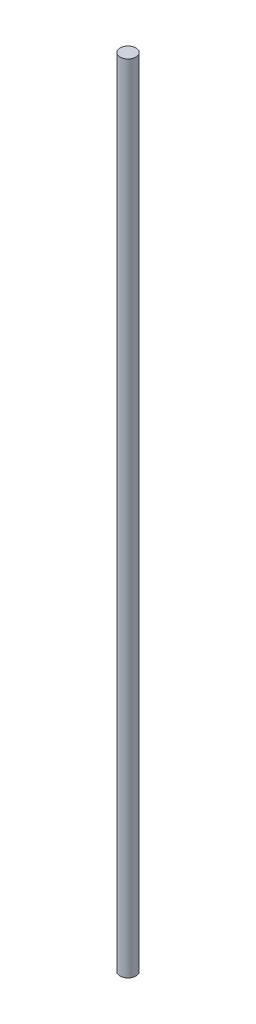
ISO-10303-21;
HEADER;
FILE_DESCRIPTION(('STEP AP214'),'2;1');
FILE_NAME('part.step','',(''),(''),'','','');
FILE_SCHEMA(('AUTOMOTIVE_DESIGN { 1 0 10303 214 1 1 1 1 }'));
ENDSEC;
DATA;
#1=APPLICATION_CONTEXT('core data for automotive mechanical design processes');
#2=APPLICATION_PROTOCOL_DEFINITION('international standard','automotive_design',2000,#1);
#3=PRODUCT_CONTEXT('',#1,'mechanical');
#4=PRODUCT('Part','Part','',(#3));
#5=PRODUCT_RELATED_PRODUCT_CATEGORY('part','',(#4));
#6=PRODUCT_DEFINITION_FORMATION('','',#4);
#7=PRODUCT_DEFINITION_CONTEXT('part definition',#1,'design');
#8=PRODUCT_DEFINITION('design','',#6,#7);
#9=PRODUCT_DEFINITION_SHAPE('','',#8);
#10=(LENGTH_UNIT() NAMED_UNIT(*) SI_UNIT(.MILLI.,.METRE.));
#11=(NAMED_UNIT(*) PLANE_ANGLE_UNIT() SI_UNIT($,.RADIAN.));
#12=(NAMED_UNIT(*) SI_UNIT($,.STERADIAN.) SOLID_ANGLE_UNIT());
#13=UNCERTAINTY_MEASURE_WITH_UNIT(LENGTH_MEASURE(1.E-05),#10,'distance_accuracy_value','');
#14=(GEOMETRIC_REPRESENTATION_CONTEXT(3) GLOBAL_UNCERTAINTY_ASSIGNED_CONTEXT((#13)) GLOBAL_UNIT_ASSIGNED_CONTEXT((#10,
#11,#12)) REPRESENTATION_CONTEXT('',''));
#15=CARTESIAN_POINT('',(0.,0.,0.));
#16=DIRECTION('',(0.,0.,1.));
#17=DIRECTION('',(1.,0.,0.));
#18=AXIS2_PLACEMENT_3D('',#15,#16,#17);
#19=CARTESIAN_POINT('',(0.,500.,0.));
#20=DIRECTION('',(0.,-1.,0.));
#21=DIRECTION('',(0.,0.,-1.));
#22=AXIS2_PLACEMENT_3D('',#19,#20,#21);
#23=CYLINDRICAL_SURFACE('',#22,5.);
#24=CARTESIAN_POINT('',(0.,500.,0.));
#25=DIRECTION('',(0.,1.,0.));
#26=DIRECTION('',(0.,0.,1.));
#27=AXIS2_PLACEMENT_3D('',#24,#25,#26);
#28=CIRCLE('',#27,5.);
#29=CARTESIAN_POINT('',(0.,500.,5.));
#30=VERTEX_POINT('',#29);
#31=EDGE_CURVE('E10',#30,#30,#28,.T.);
#32=ORIENTED_EDGE('',*,*,#31,.F.);
#33=EDGE_LOOP('',(#32));
#34=FACE_BOUND('',#33,.T.);
#35=CARTESIAN_POINT('',(0.,0.,0.));
#36=DIRECTION('',(0.,1.,0.));
#37=DIRECTION('',(0.,0.,1.));
#38=AXIS2_PLACEMENT_3D('',#35,#36,#37);
#39=CIRCLE('',#38,5.);
#40=CARTESIAN_POINT('',(0.,0.,5.));
#41=VERTEX_POINT('',#40);
#42=EDGE_CURVE('E36',#41,#41,#39,.T.);
#43=ORIENTED_EDGE('',*,*,#42,.T.);
#44=EDGE_LOOP('',(#43));
#45=FACE_BOUND('',#44,.T.);
#46=ADVANCED_FACE('F33',(#34,#45),#23,.T.);
#47=CARTESIAN_POINT('',(0.,500.,0.));
#48=DIRECTION('',(0.,1.,0.));
#49=DIRECTION('',(0.,0.,1.));
#50=AXIS2_PLACEMENT_3D('',#47,#48,#49);
#51=PLANE('',#50);
#52=ORIENTED_EDGE('',*,*,#31,.T.);
#53=EDGE_LOOP('',(#52));
#54=FACE_BOUND('',#53,.T.);
#55=ADVANCED_FACE('F48',(#54),#51,.T.);
#56=CARTESIAN_POINT('',(0.,0.,0.));
#57=DIRECTION('',(0.,1.,0.));
#58=DIRECTION('',(0.,0.,1.));
#59=AXIS2_PLACEMENT_3D('',#56,#57,#58);
#60=PLANE('',#59);
#61=ORIENTED_EDGE('',*,*,#42,.F.);
#62=EDGE_LOOP('',(#61));
#63=FACE_BOUND('',#62,.T.);
#64=ADVANCED_FACE('F46',(#63),#60,.F.);
#65=CLOSED_SHELL('',(#46,#55,#64));
#66=MANIFOLD_SOLID_BREP('B2',#65);
#67=ADVANCED_BREP_SHAPE_REPRESENTATION('',(#18,#66),#14);
#68=SHAPE_DEFINITION_REPRESENTATION(#9,#67);
ENDSEC;
END-ISO-10303-21;
